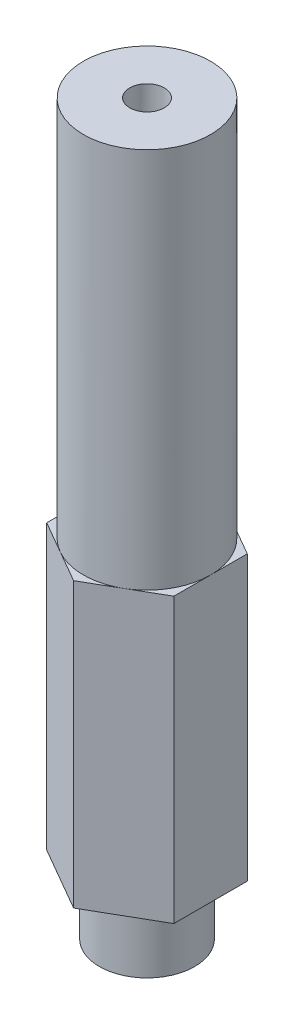
ISO-10303-21;
HEADER;
FILE_DESCRIPTION(('STEP AP214'),'2;1');
FILE_NAME('part.step','',(''),(''),'','','');
FILE_SCHEMA(('AUTOMOTIVE_DESIGN { 1 0 10303 214 1 1 1 1 }'));
ENDSEC;
DATA;
#1=APPLICATION_CONTEXT('core data for automotive mechanical design processes');
#2=APPLICATION_PROTOCOL_DEFINITION('international standard','automotive_design',2000,#1);
#3=PRODUCT_CONTEXT('',#1,'mechanical');
#4=PRODUCT('Part','Part','',(#3));
#5=PRODUCT_RELATED_PRODUCT_CATEGORY('part','',(#4));
#6=PRODUCT_DEFINITION_FORMATION('','',#4);
#7=PRODUCT_DEFINITION_CONTEXT('part definition',#1,'design');
#8=PRODUCT_DEFINITION('design','',#6,#7);
#9=PRODUCT_DEFINITION_SHAPE('','',#8);
#10=(LENGTH_UNIT() NAMED_UNIT(*) SI_UNIT(.MILLI.,.METRE.));
#11=(NAMED_UNIT(*) PLANE_ANGLE_UNIT() SI_UNIT($,.RADIAN.));
#12=(NAMED_UNIT(*) SI_UNIT($,.STERADIAN.) SOLID_ANGLE_UNIT());
#13=UNCERTAINTY_MEASURE_WITH_UNIT(LENGTH_MEASURE(1.E-05),#10,'distance_accuracy_value','');
#14=(GEOMETRIC_REPRESENTATION_CONTEXT(3) GLOBAL_UNCERTAINTY_ASSIGNED_CONTEXT((#13)) GLOBAL_UNIT_ASSIGNED_CONTEXT((#10,
#11,#12)) REPRESENTATION_CONTEXT('',''));
#15=CARTESIAN_POINT('',(0.,0.,0.));
#16=DIRECTION('',(0.,0.,1.));
#17=DIRECTION('',(1.,0.,0.));
#18=AXIS2_PLACEMENT_3D('',#15,#16,#17);
#19=CARTESIAN_POINT('',(0.,28.321,0.));
#20=DIRECTION('',(0.,1.,0.));
#21=DIRECTION('',(0.,0.,1.));
#22=AXIS2_PLACEMENT_3D('',#19,#20,#21);
#23=PLANE('',#22);
#24=CARTESIAN_POINT('',(0.,28.321,0.));
#25=DIRECTION('',(0.,1.,0.));
#26=DIRECTION('',(0.,0.,1.));
#27=AXIS2_PLACEMENT_3D('',#24,#25,#26);
#28=CIRCLE('',#27,6.35);
#29=CARTESIAN_POINT('',(3.175,28.321,5.49926131403118));
#30=VERTEX_POINT('',#29);
#31=CARTESIAN_POINT('',(6.35,28.321,0.));
#32=VERTEX_POINT('',#31);
#33=EDGE_CURVE('E45',#30,#32,#28,.T.);
#34=ORIENTED_EDGE('',*,*,#33,.F.);
#35=DIRECTION('',(0.866025403784439,0.,-0.5));
#36=VECTOR('',#35,1.);
#37=CARTESIAN_POINT('',(0.,28.321,7.33234841870825));
#38=LINE('',#37,#36);
#39=CARTESIAN_POINT('',(6.35,28.321,3.66617420935412));
#40=VERTEX_POINT('',#39);
#41=EDGE_CURVE('E141',#30,#40,#38,.T.);
#42=ORIENTED_EDGE('',*,*,#41,.T.);
#43=DIRECTION('',(0.,0.,-1.));
#44=VECTOR('',#43,1.);
#45=CARTESIAN_POINT('',(6.35,28.321,3.66617420935412));
#46=LINE('',#45,#44);
#47=EDGE_CURVE('E142',#40,#32,#46,.T.);
#48=ORIENTED_EDGE('',*,*,#47,.T.);
#49=EDGE_LOOP('',(#34,#42,#48));
#50=FACE_BOUND('',#49,.T.);
#51=ADVANCED_FACE('F34',(#50),#23,.T.);
#52=CARTESIAN_POINT('',(3.175,28.321,-5.49926131403119));
#53=VERTEX_POINT('',#52);
#54=EDGE_CURVE('E11',#32,#53,#28,.T.);
#55=ORIENTED_EDGE('',*,*,#54,.F.);
#56=CARTESIAN_POINT('',(6.35,28.321,-3.66617420935412));
#57=VERTEX_POINT('',#56);
#58=EDGE_CURVE('E140',#32,#57,#46,.T.);
#59=ORIENTED_EDGE('',*,*,#58,.T.);
#60=DIRECTION('',(-0.866025403784439,0.,-0.5));
#61=VECTOR('',#60,1.);
#62=CARTESIAN_POINT('',(6.35,28.321,-3.66617420935412));
#63=LINE('',#62,#61);
#64=EDGE_CURVE('E146',#57,#53,#63,.T.);
#65=ORIENTED_EDGE('',*,*,#64,.T.);
#66=EDGE_LOOP('',(#55,#59,#65));
#67=FACE_BOUND('',#66,.T.);
#68=ADVANCED_FACE('F239',(#67),#23,.T.);
#69=CARTESIAN_POINT('',(-3.175,28.321,-5.49926131403118));
#70=VERTEX_POINT('',#69);
#71=EDGE_CURVE('E43',#53,#70,#28,.T.);
#72=ORIENTED_EDGE('',*,*,#71,.F.);
#73=CARTESIAN_POINT('',(0.,28.321,-7.33234841870825));
#74=VERTEX_POINT('',#73);
#75=EDGE_CURVE('E145',#53,#74,#63,.T.);
#76=ORIENTED_EDGE('',*,*,#75,.T.);
#77=DIRECTION('',(-0.866025403784439,0.,0.5));
#78=VECTOR('',#77,1.);
#79=CARTESIAN_POINT('',(0.,28.321,-7.33234841870825));
#80=LINE('',#79,#78);
#81=EDGE_CURVE('E150',#74,#70,#80,.T.);
#82=ORIENTED_EDGE('',*,*,#81,.T.);
#83=EDGE_LOOP('',(#72,#76,#82));
#84=FACE_BOUND('',#83,.T.);
#85=ADVANCED_FACE('F215',(#84),#23,.T.);
#86=CARTESIAN_POINT('',(-6.35,28.321,0.));
#87=VERTEX_POINT('',#86);
#88=EDGE_CURVE('E219',#70,#87,#28,.T.);
#89=ORIENTED_EDGE('',*,*,#88,.F.);
#90=CARTESIAN_POINT('',(-6.35,28.321,-3.66617420935412));
#91=VERTEX_POINT('',#90);
#92=EDGE_CURVE('E149',#70,#91,#80,.T.);
#93=ORIENTED_EDGE('',*,*,#92,.T.);
#94=DIRECTION('',(0.,0.,1.));
#95=VECTOR('',#94,1.);
#96=CARTESIAN_POINT('',(-6.35,28.321,-3.66617420935412));
#97=LINE('',#96,#95);
#98=EDGE_CURVE('E154',#91,#87,#97,.T.);
#99=ORIENTED_EDGE('',*,*,#98,.T.);
#100=EDGE_LOOP('',(#89,#93,#99));
#101=FACE_BOUND('',#100,.T.);
#102=ADVANCED_FACE('F231',(#101),#23,.T.);
#103=CARTESIAN_POINT('',(-3.175,28.321,5.49926131403118));
#104=VERTEX_POINT('',#103);
#105=EDGE_CURVE('E60',#87,#104,#28,.T.);
#106=ORIENTED_EDGE('',*,*,#105,.F.);
#107=CARTESIAN_POINT('',(-6.35,28.321,3.66617420935412));
#108=VERTEX_POINT('',#107);
#109=EDGE_CURVE('E153',#87,#108,#97,.T.);
#110=ORIENTED_EDGE('',*,*,#109,.T.);
#111=DIRECTION('',(0.866025403784438,0.,0.5));
#112=VECTOR('',#111,1.);
#113=CARTESIAN_POINT('',(-6.35,28.321,3.66617420935412));
#114=LINE('',#113,#112);
#115=EDGE_CURVE('E158',#108,#104,#114,.T.);
#116=ORIENTED_EDGE('',*,*,#115,.T.);
#117=EDGE_LOOP('',(#106,#110,#116));
#118=FACE_BOUND('',#117,.T.);
#119=ADVANCED_FACE('F233',(#118),#23,.T.);
#120=CARTESIAN_POINT('',(0.,28.321,7.33234841870825));
#121=DIRECTION('',(-0.5,0.,-0.866025403784438));
#122=DIRECTION('',(-0.866025403784438,0.,0.5));
#123=AXIS2_PLACEMENT_3D('',#120,#121,#122);
#124=PLANE('',#123);
#125=DIRECTION('',(0.866025403784439,0.,-0.5));
#126=VECTOR('',#125,1.);
#127=CARTESIAN_POINT('',(0.,0.,7.33234841870825));
#128=LINE('',#127,#126);
#129=CARTESIAN_POINT('',(0.,0.,7.33234841870825));
#130=VERTEX_POINT('',#129);
#131=CARTESIAN_POINT('',(6.35,0.,3.66617420935412));
#132=VERTEX_POINT('',#131);
#133=EDGE_CURVE('E134',#130,#132,#128,.T.);
#134=ORIENTED_EDGE('',*,*,#133,.T.);
#135=DIRECTION('',(0.,-1.,0.));
#136=VECTOR('',#135,1.);
#137=CARTESIAN_POINT('',(6.35,28.321,3.66617420935412));
#138=LINE('',#137,#136);
#139=EDGE_CURVE('E38',#40,#132,#138,.T.);
#140=ORIENTED_EDGE('',*,*,#139,.F.);
#141=ORIENTED_EDGE('',*,*,#41,.F.);
#142=CARTESIAN_POINT('',(0.,28.321,7.33234841870825));
#143=VERTEX_POINT('',#142);
#144=EDGE_CURVE('E138',#143,#30,#38,.T.);
#145=ORIENTED_EDGE('',*,*,#144,.F.);
#146=DIRECTION('',(0.,-1.,0.));
#147=VECTOR('',#146,1.);
#148=CARTESIAN_POINT('',(0.,28.321,7.33234841870825));
#149=LINE('',#148,#147);
#150=EDGE_CURVE('E160',#143,#130,#149,.T.);
#151=ORIENTED_EDGE('',*,*,#150,.T.);
#152=EDGE_LOOP('',(#134,#140,#141,#145,#151));
#153=FACE_BOUND('',#152,.T.);
#154=ADVANCED_FACE('F36',(#153),#124,.F.);
#155=CARTESIAN_POINT('',(6.35,28.321,3.66617420935412));
#156=DIRECTION('',(-1.,0.,0.));
#157=DIRECTION('',(0.,0.,1.));
#158=AXIS2_PLACEMENT_3D('',#155,#156,#157);
#159=PLANE('',#158);
#160=DIRECTION('',(0.,0.,-1.));
#161=VECTOR('',#160,1.);
#162=CARTESIAN_POINT('',(6.35,0.,3.66617420935412));
#163=LINE('',#162,#161);
#164=CARTESIAN_POINT('',(6.35,0.,-3.66617420935412));
#165=VERTEX_POINT('',#164);
#166=EDGE_CURVE('E163',#132,#165,#163,.T.);
#167=ORIENTED_EDGE('',*,*,#166,.T.);
#168=DIRECTION('',(0.,-1.,0.));
#169=VECTOR('',#168,1.);
#170=CARTESIAN_POINT('',(6.35,28.321,-3.66617420935412));
#171=LINE('',#170,#169);
#172=EDGE_CURVE('E183',#57,#165,#171,.T.);
#173=ORIENTED_EDGE('',*,*,#172,.F.);
#174=ORIENTED_EDGE('',*,*,#58,.F.);
#175=ORIENTED_EDGE('',*,*,#47,.F.);
#176=ORIENTED_EDGE('',*,*,#139,.T.);
#177=EDGE_LOOP('',(#167,#173,#174,#175,#176));
#178=FACE_BOUND('',#177,.T.);
#179=ADVANCED_FACE('F193',(#178),#159,.F.);
#180=CARTESIAN_POINT('',(6.35,28.321,-3.66617420935412));
#181=DIRECTION('',(-0.5,0.,0.866025403784439));
#182=DIRECTION('',(0.866025403784439,0.,0.5));
#183=AXIS2_PLACEMENT_3D('',#180,#181,#182);
#184=PLANE('',#183);
#185=DIRECTION('',(-0.866025403784439,0.,-0.5));
#186=VECTOR('',#185,1.);
#187=CARTESIAN_POINT('',(6.35,0.,-3.66617420935412));
#188=LINE('',#187,#186);
#189=CARTESIAN_POINT('',(0.,0.,-7.33234841870825));
#190=VERTEX_POINT('',#189);
#191=EDGE_CURVE('E165',#165,#190,#188,.T.);
#192=ORIENTED_EDGE('',*,*,#191,.T.);
#193=DIRECTION('',(0.,-1.,0.));
#194=VECTOR('',#193,1.);
#195=CARTESIAN_POINT('',(0.,28.321,-7.33234841870825));
#196=LINE('',#195,#194);
#197=EDGE_CURVE('E181',#74,#190,#196,.T.);
#198=ORIENTED_EDGE('',*,*,#197,.F.);
#199=ORIENTED_EDGE('',*,*,#75,.F.);
#200=ORIENTED_EDGE('',*,*,#64,.F.);
#201=ORIENTED_EDGE('',*,*,#172,.T.);
#202=EDGE_LOOP('',(#192,#198,#199,#200,#201));
#203=FACE_BOUND('',#202,.T.);
#204=ADVANCED_FACE('F206',(#203),#184,.F.);
#205=CARTESIAN_POINT('',(0.,28.321,-7.33234841870825));
#206=DIRECTION('',(0.5,0.,0.866025403784439));
#207=DIRECTION('',(0.866025403784439,0.,-0.5));
#208=AXIS2_PLACEMENT_3D('',#205,#206,#207);
#209=PLANE('',#208);
#210=DIRECTION('',(-0.866025403784439,0.,0.5));
#211=VECTOR('',#210,1.);
#212=CARTESIAN_POINT('',(0.,0.,-7.33234841870825));
#213=LINE('',#212,#211);
#214=CARTESIAN_POINT('',(-6.35,0.,-3.66617420935412));
#215=VERTEX_POINT('',#214);
#216=EDGE_CURVE('E167',#190,#215,#213,.T.);
#217=ORIENTED_EDGE('',*,*,#216,.T.);
#218=DIRECTION('',(0.,-1.,0.));
#219=VECTOR('',#218,1.);
#220=CARTESIAN_POINT('',(-6.35,28.321,-3.66617420935412));
#221=LINE('',#220,#219);
#222=EDGE_CURVE('E178',#91,#215,#221,.T.);
#223=ORIENTED_EDGE('',*,*,#222,.F.);
#224=ORIENTED_EDGE('',*,*,#92,.F.);
#225=ORIENTED_EDGE('',*,*,#81,.F.);
#226=ORIENTED_EDGE('',*,*,#197,.T.);
#227=EDGE_LOOP('',(#217,#223,#224,#225,#226));
#228=FACE_BOUND('',#227,.T.);
#229=ADVANCED_FACE('F210',(#228),#209,.F.);
#230=CARTESIAN_POINT('',(-6.35,28.321,-3.66617420935412));
#231=DIRECTION('',(1.,0.,0.));
#232=DIRECTION('',(0.,0.,-1.));
#233=AXIS2_PLACEMENT_3D('',#230,#231,#232);
#234=PLANE('',#233);
#235=DIRECTION('',(0.,0.,1.));
#236=VECTOR('',#235,1.);
#237=CARTESIAN_POINT('',(-6.35,0.,-3.66617420935412));
#238=LINE('',#237,#236);
#239=CARTESIAN_POINT('',(-6.35,0.,3.66617420935412));
#240=VERTEX_POINT('',#239);
#241=EDGE_CURVE('E169',#215,#240,#238,.T.);
#242=ORIENTED_EDGE('',*,*,#241,.T.);
#243=DIRECTION('',(0.,-1.,0.));
#244=VECTOR('',#243,1.);
#245=CARTESIAN_POINT('',(-6.35,28.321,3.66617420935412));
#246=LINE('',#245,#244);
#247=EDGE_CURVE('E175',#108,#240,#246,.T.);
#248=ORIENTED_EDGE('',*,*,#247,.F.);
#249=ORIENTED_EDGE('',*,*,#109,.F.);
#250=ORIENTED_EDGE('',*,*,#98,.F.);
#251=ORIENTED_EDGE('',*,*,#222,.T.);
#252=EDGE_LOOP('',(#242,#248,#249,#250,#251));
#253=FACE_BOUND('',#252,.T.);
#254=ADVANCED_FACE('F228',(#253),#234,.F.);
#255=CARTESIAN_POINT('',(-6.35,28.321,3.66617420935412));
#256=DIRECTION('',(0.5,0.,-0.866025403784439));
#257=DIRECTION('',(-0.866025403784439,0.,-0.5));
#258=AXIS2_PLACEMENT_3D('',#255,#256,#257);
#259=PLANE('',#258);
#260=DIRECTION('',(0.866025403784438,0.,0.5));
#261=VECTOR('',#260,1.);
#262=CARTESIAN_POINT('',(-6.35,0.,3.66617420935412));
#263=LINE('',#262,#261);
#264=EDGE_CURVE('E171',#240,#130,#263,.T.);
#265=ORIENTED_EDGE('',*,*,#264,.T.);
#266=ORIENTED_EDGE('',*,*,#150,.F.);
#267=EDGE_CURVE('E157',#104,#143,#114,.T.);
#268=ORIENTED_EDGE('',*,*,#267,.F.);
#269=ORIENTED_EDGE('',*,*,#115,.F.);
#270=ORIENTED_EDGE('',*,*,#247,.T.);
#271=EDGE_LOOP('',(#265,#266,#268,#269,#270));
#272=FACE_BOUND('',#271,.T.);
#273=ADVANCED_FACE('F225',(#272),#259,.F.);
#274=EDGE_CURVE('E52',#104,#30,#28,.T.);
#275=ORIENTED_EDGE('',*,*,#274,.F.);
#276=ORIENTED_EDGE('',*,*,#267,.T.);
#277=ORIENTED_EDGE('',*,*,#144,.T.);
#278=EDGE_LOOP('',(#275,#276,#277));
#279=FACE_BOUND('',#278,.T.);
#280=ADVANCED_FACE('F222',(#279),#23,.T.);
#281=CARTESIAN_POINT('',(0.,0.,0.));
#282=DIRECTION('',(0.,1.,0.));
#283=DIRECTION('',(0.,0.,1.));
#284=AXIS2_PLACEMENT_3D('',#281,#282,#283);
#285=PLANE('',#284);
#286=CARTESIAN_POINT('',(0.,0.,0.));
#287=DIRECTION('',(0.,-1.,0.));
#288=DIRECTION('',(0.,0.,-1.));
#289=AXIS2_PLACEMENT_3D('',#286,#287,#288);
#290=CIRCLE('',#289,4.7625);
#291=CARTESIAN_POINT('',(0.,0.,-4.7625));
#292=VERTEX_POINT('',#291);
#293=EDGE_CURVE('E135',#292,#292,#290,.T.);
#294=ORIENTED_EDGE('',*,*,#293,.F.);
#295=EDGE_LOOP('',(#294));
#296=FACE_BOUND('',#295,.T.);
#297=ORIENTED_EDGE('',*,*,#133,.F.);
#298=ORIENTED_EDGE('',*,*,#264,.F.);
#299=ORIENTED_EDGE('',*,*,#241,.F.);
#300=ORIENTED_EDGE('',*,*,#216,.F.);
#301=ORIENTED_EDGE('',*,*,#191,.F.);
#302=ORIENTED_EDGE('',*,*,#166,.F.);
#303=EDGE_LOOP('',(#297,#298,#299,#300,#301,#302));
#304=FACE_BOUND('',#303,.T.);
#305=ADVANCED_FACE('F202',(#296,#304),#285,.F.);
#306=CARTESIAN_POINT('',(0.,-6.35,0.));
#307=DIRECTION('',(0.,1.,0.));
#308=DIRECTION('',(0.,0.,1.));
#309=AXIS2_PLACEMENT_3D('',#306,#307,#308);
#310=CYLINDRICAL_SURFACE('',#309,4.7625);
#311=CARTESIAN_POINT('',(0.,-6.35,0.));
#312=DIRECTION('',(0.,-1.,0.));
#313=DIRECTION('',(0.,0.,-1.));
#314=AXIS2_PLACEMENT_3D('',#311,#312,#313);
#315=CIRCLE('',#314,4.7625);
#316=CARTESIAN_POINT('',(0.,-6.35,-4.7625));
#317=VERTEX_POINT('',#316);
#318=EDGE_CURVE('E130',#317,#317,#315,.T.);
#319=ORIENTED_EDGE('',*,*,#318,.F.);
#320=EDGE_LOOP('',(#319));
#321=FACE_BOUND('',#320,.T.);
#322=ORIENTED_EDGE('',*,*,#293,.T.);
#323=EDGE_LOOP('',(#322));
#324=FACE_BOUND('',#323,.T.);
#325=ADVANCED_FACE('F252',(#321,#324),#310,.T.);
#326=CARTESIAN_POINT('',(0.,-6.35,0.));
#327=DIRECTION('',(0.,-1.,0.));
#328=DIRECTION('',(0.,0.,-1.));
#329=AXIS2_PLACEMENT_3D('',#326,#327,#328);
#330=PLANE('',#329);
#331=CARTESIAN_POINT('',(0.,-6.35,0.));
#332=DIRECTION('',(0.,-1.,0.));
#333=DIRECTION('',(0.,0.,-1.));
#334=AXIS2_PLACEMENT_3D('',#331,#332,#333);
#335=CIRCLE('',#334,3.175);
#336=CARTESIAN_POINT('',(0.,-6.35,-3.175));
#337=VERTEX_POINT('',#336);
#338=EDGE_CURVE('E409',#337,#337,#335,.T.);
#339=ORIENTED_EDGE('',*,*,#338,.F.);
#340=EDGE_LOOP('',(#339));
#341=FACE_BOUND('',#340,.T.);
#342=ORIENTED_EDGE('',*,*,#318,.T.);
#343=EDGE_LOOP('',(#342));
#344=FACE_BOUND('',#343,.T.);
#345=ADVANCED_FACE('F304',(#341,#344),#330,.T.);
#346=CARTESIAN_POINT('',(0.,66.421,0.));
#347=DIRECTION('',(0.,-1.,0.));
#348=DIRECTION('',(0.,0.,-1.));
#349=AXIS2_PLACEMENT_3D('',#346,#347,#348);
#350=CYLINDRICAL_SURFACE('',#349,6.35);
#351=CARTESIAN_POINT('',(0.,66.421,0.));
#352=DIRECTION('',(0.,1.,0.));
#353=DIRECTION('',(0.,0.,1.));
#354=AXIS2_PLACEMENT_3D('',#351,#352,#353);
#355=CIRCLE('',#354,6.35);
#356=CARTESIAN_POINT('',(0.,66.421,6.35));
#357=VERTEX_POINT('',#356);
#358=EDGE_CURVE('E123',#357,#357,#355,.T.);
#359=ORIENTED_EDGE('',*,*,#358,.F.);
#360=EDGE_LOOP('',(#359));
#361=FACE_BOUND('',#360,.T.);
#362=ORIENTED_EDGE('',*,*,#33,.T.);
#363=ORIENTED_EDGE('',*,*,#54,.T.);
#364=ORIENTED_EDGE('',*,*,#71,.T.);
#365=ORIENTED_EDGE('',*,*,#88,.T.);
#366=ORIENTED_EDGE('',*,*,#105,.T.);
#367=ORIENTED_EDGE('',*,*,#274,.T.);
#368=EDGE_LOOP('',(#362,#363,#364,#365,#366,#367));
#369=FACE_BOUND('',#368,.T.);
#370=ADVANCED_FACE('F218',(#361,#369),#350,.T.);
#371=CARTESIAN_POINT('',(0.,66.421,0.));
#372=DIRECTION('',(0.,1.,0.));
#373=DIRECTION('',(0.,0.,1.));
#374=AXIS2_PLACEMENT_3D('',#371,#372,#373);
#375=PLANE('',#374);
#376=CARTESIAN_POINT('',(0.,66.421,0.));
#377=DIRECTION('',(0.,1.,0.));
#378=DIRECTION('',(0.,0.,1.));
#379=AXIS2_PLACEMENT_3D('',#376,#377,#378);
#380=CIRCLE('',#379,1.7272);
#381=CARTESIAN_POINT('',(0.,66.421,1.7272));
#382=VERTEX_POINT('',#381);
#383=EDGE_CURVE('E120',#382,#382,#380,.T.);
#384=ORIENTED_EDGE('',*,*,#383,.F.);
#385=EDGE_LOOP('',(#384));
#386=FACE_BOUND('',#385,.T.);
#387=ORIENTED_EDGE('',*,*,#358,.T.);
#388=EDGE_LOOP('',(#387));
#389=FACE_BOUND('',#388,.T.);
#390=ADVANCED_FACE('F114',(#386,#389),#375,.T.);
#391=CARTESIAN_POINT('',(0.,55.753,0.));
#392=DIRECTION('',(0.,1.,0.));
#393=DIRECTION('',(0.,0.,1.));
#394=AXIS2_PLACEMENT_3D('',#391,#392,#393);
#395=CONICAL_SURFACE('',#394,1.7272,1.02974425867665);
#396=CARTESIAN_POINT('',(0.,54.7151935388156,0.));
#397=VERTEX_POINT('',#396);
#398=VERTEX_LOOP('',#397);
#399=FACE_BOUND('',#398,.T.);
#400=CARTESIAN_POINT('',(0.,55.753,0.));
#401=DIRECTION('',(0.,1.,0.));
#402=DIRECTION('',(0.,0.,1.));
#403=AXIS2_PLACEMENT_3D('',#400,#401,#402);
#404=CIRCLE('',#403,1.7272);
#405=CARTESIAN_POINT('',(0.,55.753,1.7272));
#406=VERTEX_POINT('',#405);
#407=EDGE_CURVE('E118',#406,#406,#404,.T.);
#408=ORIENTED_EDGE('',*,*,#407,.T.);
#409=EDGE_LOOP('',(#408));
#410=FACE_BOUND('',#409,.T.);
#411=ADVANCED_FACE('F110',(#399,#410),#395,.F.);
#412=CARTESIAN_POINT('',(0.,66.421,0.));
#413=DIRECTION('',(0.,1.,0.));
#414=DIRECTION('',(0.,0.,1.));
#415=AXIS2_PLACEMENT_3D('',#412,#413,#414);
#416=CYLINDRICAL_SURFACE('',#415,1.7272);
#417=ORIENTED_EDGE('',*,*,#407,.F.);
#418=EDGE_LOOP('',(#417));
#419=FACE_BOUND('',#418,.T.);
#420=ORIENTED_EDGE('',*,*,#383,.T.);
#421=EDGE_LOOP('',(#420));
#422=FACE_BOUND('',#421,.T.);
#423=ADVANCED_FACE('F113',(#419,#422),#416,.F.);
#424=CARTESIAN_POINT('',(0.,0.,0.));
#425=DIRECTION('',(0.,-1.,0.));
#426=DIRECTION('',(0.,0.,-1.));
#427=AXIS2_PLACEMENT_3D('',#424,#425,#426);
#428=CYLINDRICAL_SURFACE('',#427,3.175);
#429=CARTESIAN_POINT('',(0.,0.,0.));
#430=DIRECTION('',(0.,-1.,0.));
#431=DIRECTION('',(0.,0.,-1.));
#432=AXIS2_PLACEMENT_3D('',#429,#430,#431);
#433=CIRCLE('',#432,3.175);
#434=CARTESIAN_POINT('',(0.,0.,-3.175));
#435=VERTEX_POINT('',#434);
#436=EDGE_CURVE('E125',#435,#435,#433,.T.);
#437=ORIENTED_EDGE('',*,*,#436,.F.);
#438=EDGE_LOOP('',(#437));
#439=FACE_BOUND('',#438,.T.);
#440=ORIENTED_EDGE('',*,*,#338,.T.);
#441=EDGE_LOOP('',(#440));
#442=FACE_BOUND('',#441,.T.);
#443=ADVANCED_FACE('F376',(#439,#442),#428,.F.);
#444=CARTESIAN_POINT('',(0.,0.,0.));
#445=DIRECTION('',(0.,-1.,0.));
#446=DIRECTION('',(0.,0.,-1.));
#447=AXIS2_PLACEMENT_3D('',#444,#445,#446);
#448=PLANE('',#447);
#449=ORIENTED_EDGE('',*,*,#436,.T.);
#450=EDGE_LOOP('',(#449));
#451=FACE_BOUND('',#450,.T.);
#452=ADVANCED_FACE('F393',(#451),#448,.T.);
#453=CLOSED_SHELL('',(#51,#68,#85,#102,#119,#154,#179,#204,#229,#254,#273,#280,#305,#325,#345,
#370,#390,#411,#423,#443,#452));
#454=MANIFOLD_SOLID_BREP('B2',#453);
#455=ADVANCED_BREP_SHAPE_REPRESENTATION('',(#18,#454),#14);
#456=SHAPE_DEFINITION_REPRESENTATION(#9,#455);
ENDSEC;
END-ISO-10303-21;
